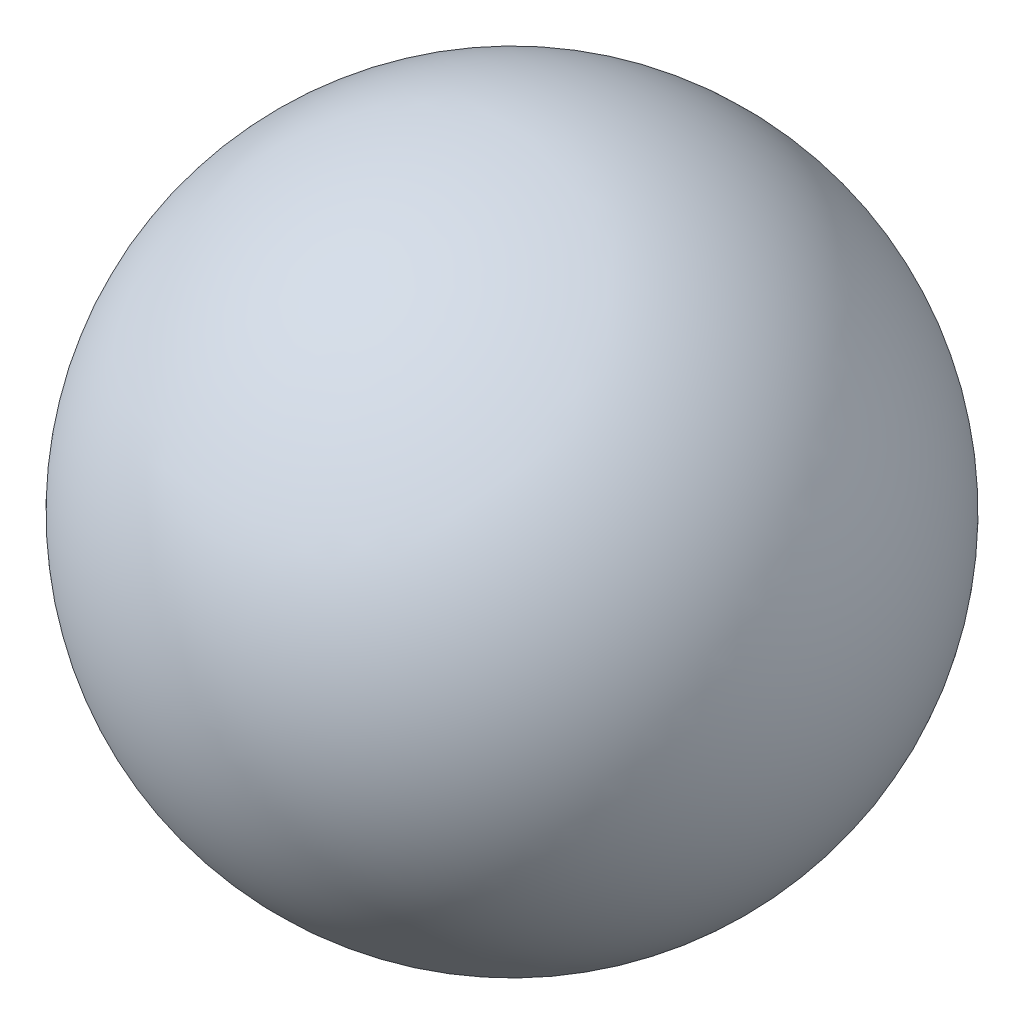
ISO-10303-21;
HEADER;
FILE_DESCRIPTION(('STEP AP214'),'2;1');
FILE_NAME('part.step','',(''),(''),'','','');
FILE_SCHEMA(('AUTOMOTIVE_DESIGN { 1 0 10303 214 1 1 1 1 }'));
ENDSEC;
DATA;
#1=APPLICATION_CONTEXT('core data for automotive mechanical design processes');
#2=APPLICATION_PROTOCOL_DEFINITION('international standard','automotive_design',2000,#1);
#3=PRODUCT_CONTEXT('',#1,'mechanical');
#4=PRODUCT('Part','Part','',(#3));
#5=PRODUCT_RELATED_PRODUCT_CATEGORY('part','',(#4));
#6=PRODUCT_DEFINITION_FORMATION('','',#4);
#7=PRODUCT_DEFINITION_CONTEXT('part definition',#1,'design');
#8=PRODUCT_DEFINITION('design','',#6,#7);
#9=PRODUCT_DEFINITION_SHAPE('','',#8);
#10=(LENGTH_UNIT() NAMED_UNIT(*) SI_UNIT(.MILLI.,.METRE.));
#11=(NAMED_UNIT(*) PLANE_ANGLE_UNIT() SI_UNIT($,.RADIAN.));
#12=(NAMED_UNIT(*) SI_UNIT($,.STERADIAN.) SOLID_ANGLE_UNIT());
#13=UNCERTAINTY_MEASURE_WITH_UNIT(LENGTH_MEASURE(1.E-05),#10,'distance_accuracy_value','');
#14=(GEOMETRIC_REPRESENTATION_CONTEXT(3) GLOBAL_UNCERTAINTY_ASSIGNED_CONTEXT((#13)) GLOBAL_UNIT_ASSIGNED_CONTEXT((#10,
#11,#12)) REPRESENTATION_CONTEXT('',''));
#15=CARTESIAN_POINT('',(0.,0.,0.));
#16=DIRECTION('',(0.,0.,1.));
#17=DIRECTION('',(1.,0.,0.));
#18=AXIS2_PLACEMENT_3D('',#15,#16,#17);
#19=CARTESIAN_POINT('',(64.16,51.118928564109,-46.9132799051348));
#20=DIRECTION('',(0.,0.736764460517836,-0.676149487700658));
#21=DIRECTION('',(0.173648177666933,0.66587725768284,0.725571352861821));
#22=AXIS2_PLACEMENT_3D('',#19,#20,#21);
#23=SPHERICAL_SURFACE('',#22,7.15);
#24=CARTESIAN_POINT('',(64.16,56.3867944568115,-51.7477487421945));
#25=VERTEX_POINT('',#24);
#26=VERTEX_LOOP('',#25);
#27=FACE_BOUND('',#26,.T.);
#28=CARTESIAN_POINT('',(64.16,45.8510626714065,-42.0788110680751));
#29=VERTEX_POINT('',#28);
#30=VERTEX_LOOP('',#29);
#31=FACE_BOUND('',#30,.T.);
#32=ADVANCED_FACE('F15',(#27,#31),#23,.T.);
#33=CLOSED_SHELL('',(#32));
#34=MANIFOLD_SOLID_BREP('B1',#33);
#35=ADVANCED_BREP_SHAPE_REPRESENTATION('',(#18,#34),#14);
#36=SHAPE_DEFINITION_REPRESENTATION(#9,#35);
ENDSEC;
END-ISO-10303-21;
